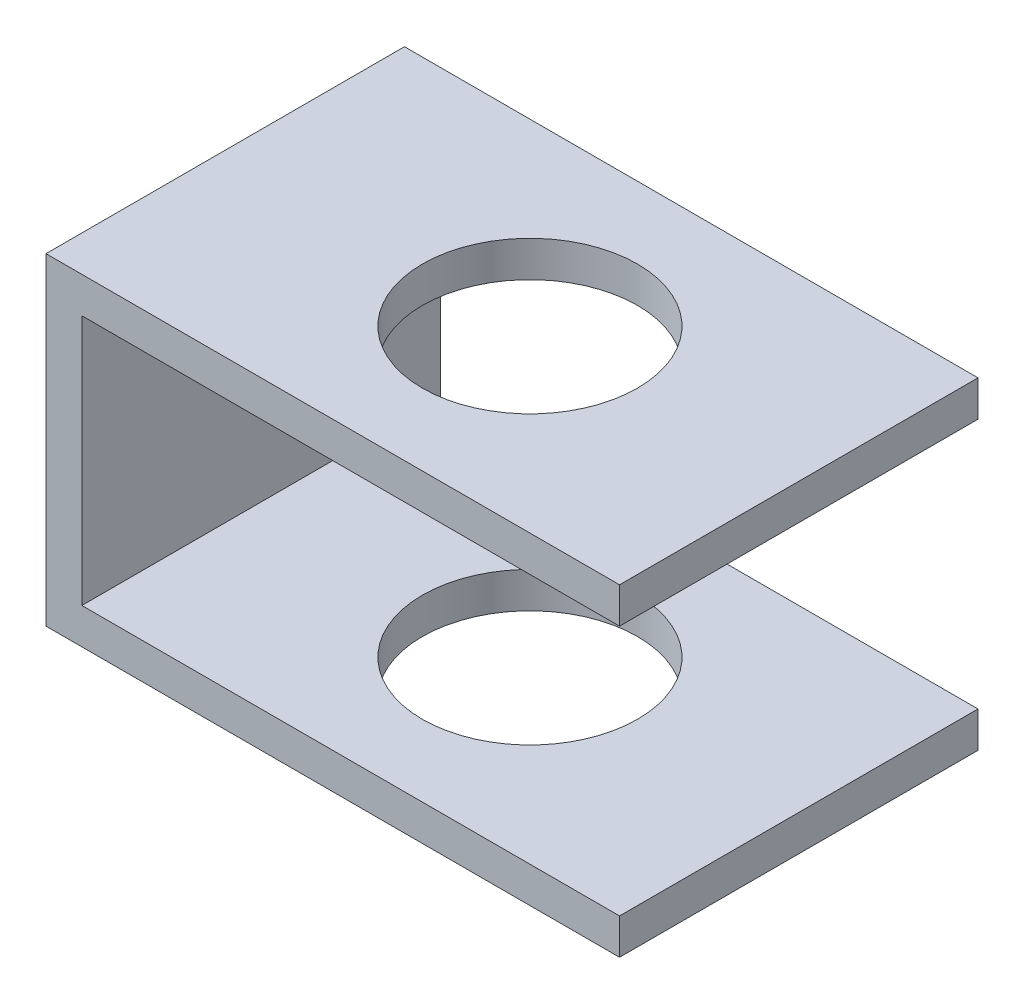
ISO-10303-21;
HEADER;
FILE_DESCRIPTION(('STEP AP214'),'2;1');
FILE_NAME('part.step','',(''),(''),'','','');
FILE_SCHEMA(('AUTOMOTIVE_DESIGN { 1 0 10303 214 1 1 1 1 }'));
ENDSEC;
DATA;
#1=APPLICATION_CONTEXT('core data for automotive mechanical design processes');
#2=APPLICATION_PROTOCOL_DEFINITION('international standard','automotive_design',2000,#1);
#3=PRODUCT_CONTEXT('',#1,'mechanical');
#4=PRODUCT('Part','Part','',(#3));
#5=PRODUCT_RELATED_PRODUCT_CATEGORY('part','',(#4));
#6=PRODUCT_DEFINITION_FORMATION('','',#4);
#7=PRODUCT_DEFINITION_CONTEXT('part definition',#1,'design');
#8=PRODUCT_DEFINITION('design','',#6,#7);
#9=PRODUCT_DEFINITION_SHAPE('','',#8);
#10=(LENGTH_UNIT() NAMED_UNIT(*) SI_UNIT(.MILLI.,.METRE.));
#11=(NAMED_UNIT(*) PLANE_ANGLE_UNIT() SI_UNIT($,.RADIAN.));
#12=(NAMED_UNIT(*) SI_UNIT($,.STERADIAN.) SOLID_ANGLE_UNIT());
#13=UNCERTAINTY_MEASURE_WITH_UNIT(LENGTH_MEASURE(1.E-05),#10,'distance_accuracy_value','');
#14=(GEOMETRIC_REPRESENTATION_CONTEXT(3) GLOBAL_UNCERTAINTY_ASSIGNED_CONTEXT((#13)) GLOBAL_UNIT_ASSIGNED_CONTEXT((#10,
#11,#12)) REPRESENTATION_CONTEXT('',''));
#15=CARTESIAN_POINT('',(0.,0.,0.));
#16=DIRECTION('',(0.,0.,1.));
#17=DIRECTION('',(1.,0.,0.));
#18=AXIS2_PLACEMENT_3D('',#15,#16,#17);
#19=CARTESIAN_POINT('',(1.6,0.,1.));
#20=DIRECTION('',(-1.,0.,0.));
#21=DIRECTION('',(0.,0.,1.));
#22=AXIS2_PLACEMENT_3D('',#19,#20,#21);
#23=PLANE('',#22);
#24=DIRECTION('',(0.,1.,0.));
#25=VECTOR('',#24,1.);
#26=CARTESIAN_POINT('',(1.6,0.,1.));
#27=LINE('',#26,#25);
#28=CARTESIAN_POINT('',(1.6,-0.1,1.));
#29=VERTEX_POINT('',#28);
#30=CARTESIAN_POINT('',(1.6,0.,1.));
#31=VERTEX_POINT('',#30);
#32=EDGE_CURVE('E146',#29,#31,#27,.T.);
#33=ORIENTED_EDGE('',*,*,#32,.F.);
#34=DIRECTION('',(0.,0.,1.));
#35=VECTOR('',#34,1.);
#36=CARTESIAN_POINT('',(1.6,-0.1,1.));
#37=LINE('',#36,#35);
#38=CARTESIAN_POINT('',(1.6,-0.1,0.));
#39=VERTEX_POINT('',#38);
#40=EDGE_CURVE('E124',#39,#29,#37,.T.);
#41=ORIENTED_EDGE('',*,*,#40,.F.);
#42=DIRECTION('',(0.,1.,0.));
#43=VECTOR('',#42,1.);
#44=CARTESIAN_POINT('',(1.6,0.,0.));
#45=LINE('',#44,#43);
#46=CARTESIAN_POINT('',(1.6,0.,0.));
#47=VERTEX_POINT('',#46);
#48=EDGE_CURVE('E154',#39,#47,#45,.T.);
#49=ORIENTED_EDGE('',*,*,#48,.T.);
#50=DIRECTION('',(0.,0.,-1.));
#51=VECTOR('',#50,1.);
#52=CARTESIAN_POINT('',(1.6,0.,1.));
#53=LINE('',#52,#51);
#54=EDGE_CURVE('E160',#31,#47,#53,.T.);
#55=ORIENTED_EDGE('',*,*,#54,.F.);
#56=EDGE_LOOP('',(#33,#41,#49,#55));
#57=FACE_BOUND('',#56,.T.);
#58=ADVANCED_FACE('F33',(#57),#23,.F.);
#59=CARTESIAN_POINT('',(0.85,-1.,0.5));
#60=DIRECTION('',(0.,1.,0.));
#61=DIRECTION('',(0.,0.,1.));
#62=AXIS2_PLACEMENT_3D('',#59,#60,#61);
#63=CYLINDRICAL_SURFACE('',#62,0.3);
#64=CARTESIAN_POINT('',(0.85,-0.1,0.5));
#65=DIRECTION('',(0.,1.,0.));
#66=DIRECTION('',(0.,0.,1.));
#67=AXIS2_PLACEMENT_3D('',#64,#65,#66);
#68=CIRCLE('',#67,0.3);
#69=CARTESIAN_POINT('',(0.85,-0.1,0.8));
#70=VERTEX_POINT('',#69);
#71=EDGE_CURVE('E37',#70,#70,#68,.F.);
#72=ORIENTED_EDGE('',*,*,#71,.T.);
#73=EDGE_LOOP('',(#72));
#74=FACE_BOUND('',#73,.T.);
#75=CARTESIAN_POINT('',(0.85,0.,0.5));
#76=DIRECTION('',(0.,1.,0.));
#77=DIRECTION('',(0.,0.,1.));
#78=AXIS2_PLACEMENT_3D('',#75,#76,#77);
#79=CIRCLE('',#78,0.3);
#80=CARTESIAN_POINT('',(0.85,0.,0.8));
#81=VERTEX_POINT('',#80);
#82=EDGE_CURVE('E136',#81,#81,#79,.T.);
#83=ORIENTED_EDGE('',*,*,#82,.T.);
#84=EDGE_LOOP('',(#83));
#85=FACE_BOUND('',#84,.T.);
#86=ADVANCED_FACE('F204',(#74,#85),#63,.F.);
#87=CARTESIAN_POINT('',(0.,0.,1.));
#88=DIRECTION('',(1.,0.,0.));
#89=DIRECTION('',(0.,1.,0.));
#90=AXIS2_PLACEMENT_3D('',#87,#88,#89);
#91=PLANE('',#90);
#92=DIRECTION('',(0.,-1.,0.));
#93=VECTOR('',#92,1.);
#94=CARTESIAN_POINT('',(0.,0.,0.));
#95=LINE('',#94,#93);
#96=CARTESIAN_POINT('',(0.,0.,0.));
#97=VERTEX_POINT('',#96);
#98=CARTESIAN_POINT('',(0.,-0.9,0.));
#99=VERTEX_POINT('',#98);
#100=EDGE_CURVE('E142',#97,#99,#95,.T.);
#101=ORIENTED_EDGE('',*,*,#100,.T.);
#102=DIRECTION('',(0.,0.,-1.));
#103=VECTOR('',#102,1.);
#104=CARTESIAN_POINT('',(0.,-0.9,1.));
#105=LINE('',#104,#103);
#106=CARTESIAN_POINT('',(0.,-0.9,1.));
#107=VERTEX_POINT('',#106);
#108=EDGE_CURVE('E11',#107,#99,#105,.T.);
#109=ORIENTED_EDGE('',*,*,#108,.F.);
#110=DIRECTION('',(0.,-1.,0.));
#111=VECTOR('',#110,1.);
#112=CARTESIAN_POINT('',(0.,0.,1.));
#113=LINE('',#112,#111);
#114=CARTESIAN_POINT('',(0.,0.,1.));
#115=VERTEX_POINT('',#114);
#116=EDGE_CURVE('E143',#115,#107,#113,.T.);
#117=ORIENTED_EDGE('',*,*,#116,.F.);
#118=DIRECTION('',(0.,0.,-1.));
#119=VECTOR('',#118,1.);
#120=CARTESIAN_POINT('',(0.,0.,1.));
#121=LINE('',#120,#119);
#122=EDGE_CURVE('E149',#115,#97,#121,.T.);
#123=ORIENTED_EDGE('',*,*,#122,.T.);
#124=EDGE_LOOP('',(#101,#109,#117,#123));
#125=FACE_BOUND('',#124,.T.);
#126=ADVANCED_FACE('F35',(#125),#91,.F.);
#127=CARTESIAN_POINT('',(0.,-0.9,1.));
#128=DIRECTION('',(0.,1.,0.));
#129=DIRECTION('',(0.,0.,1.));
#130=AXIS2_PLACEMENT_3D('',#127,#128,#129);
#131=PLANE('',#130);
#132=CARTESIAN_POINT('',(0.85,-0.9,0.5));
#133=DIRECTION('',(0.,1.,0.));
#134=DIRECTION('',(0.,0.,1.));
#135=AXIS2_PLACEMENT_3D('',#132,#133,#134);
#136=CIRCLE('',#135,0.3);
#137=CARTESIAN_POINT('',(0.85,-0.9,0.8));
#138=VERTEX_POINT('',#137);
#139=EDGE_CURVE('E139',#138,#138,#136,.T.);
#140=ORIENTED_EDGE('',*,*,#139,.T.);
#141=EDGE_LOOP('',(#140));
#142=FACE_BOUND('',#141,.T.);
#143=DIRECTION('',(1.,0.,0.));
#144=VECTOR('',#143,1.);
#145=CARTESIAN_POINT('',(0.,-0.9,0.));
#146=LINE('',#145,#144);
#147=CARTESIAN_POINT('',(1.6,-0.9,0.));
#148=VERTEX_POINT('',#147);
#149=EDGE_CURVE('E152',#99,#148,#146,.T.);
#150=ORIENTED_EDGE('',*,*,#149,.T.);
#151=DIRECTION('',(0.,0.,-1.));
#152=VECTOR('',#151,1.);
#153=CARTESIAN_POINT('',(1.6,-0.9,1.));
#154=LINE('',#153,#152);
#155=CARTESIAN_POINT('',(1.6,-0.9,1.));
#156=VERTEX_POINT('',#155);
#157=EDGE_CURVE('E42',#156,#148,#154,.T.);
#158=ORIENTED_EDGE('',*,*,#157,.F.);
#159=DIRECTION('',(1.,0.,0.));
#160=VECTOR('',#159,1.);
#161=CARTESIAN_POINT('',(0.,-0.9,1.));
#162=LINE('',#161,#160);
#163=EDGE_CURVE('E87',#107,#156,#162,.T.);
#164=ORIENTED_EDGE('',*,*,#163,.F.);
#165=ORIENTED_EDGE('',*,*,#108,.T.);
#166=EDGE_LOOP('',(#150,#158,#164,#165));
#167=FACE_BOUND('',#166,.T.);
#168=ADVANCED_FACE('F190',(#142,#167),#131,.F.);
#169=CARTESIAN_POINT('',(1.6,-0.8,0.));
#170=VERTEX_POINT('',#169);
#171=EDGE_CURVE('E155',#148,#170,#45,.T.);
#172=ORIENTED_EDGE('',*,*,#171,.T.);
#173=DIRECTION('',(0.,0.,-1.));
#174=VECTOR('',#173,1.);
#175=CARTESIAN_POINT('',(1.6,-0.8,1.));
#176=LINE('',#175,#174);
#177=CARTESIAN_POINT('',(1.6,-0.8,1.));
#178=VERTEX_POINT('',#177);
#179=EDGE_CURVE('E173',#178,#170,#176,.T.);
#180=ORIENTED_EDGE('',*,*,#179,.F.);
#181=EDGE_CURVE('E129',#156,#178,#27,.T.);
#182=ORIENTED_EDGE('',*,*,#181,.F.);
#183=ORIENTED_EDGE('',*,*,#157,.T.);
#184=EDGE_LOOP('',(#172,#180,#182,#183));
#185=FACE_BOUND('',#184,.T.);
#186=ADVANCED_FACE('F193',(#185),#23,.F.);
#187=CARTESIAN_POINT('',(0.,0.,1.));
#188=DIRECTION('',(0.,-1.,0.));
#189=DIRECTION('',(0.,0.,-1.));
#190=AXIS2_PLACEMENT_3D('',#187,#188,#189);
#191=PLANE('',#190);
#192=ORIENTED_EDGE('',*,*,#82,.F.);
#193=EDGE_LOOP('',(#192));
#194=FACE_BOUND('',#193,.T.);
#195=DIRECTION('',(-1.,0.,0.));
#196=VECTOR('',#195,1.);
#197=CARTESIAN_POINT('',(0.,0.,0.));
#198=LINE('',#197,#196);
#199=EDGE_CURVE('E80',#47,#97,#198,.T.);
#200=ORIENTED_EDGE('',*,*,#199,.T.);
#201=ORIENTED_EDGE('',*,*,#122,.F.);
#202=DIRECTION('',(-1.,0.,0.));
#203=VECTOR('',#202,1.);
#204=CARTESIAN_POINT('',(0.,0.,1.));
#205=LINE('',#204,#203);
#206=EDGE_CURVE('E59',#31,#115,#205,.T.);
#207=ORIENTED_EDGE('',*,*,#206,.F.);
#208=ORIENTED_EDGE('',*,*,#54,.T.);
#209=EDGE_LOOP('',(#200,#201,#207,#208));
#210=FACE_BOUND('',#209,.T.);
#211=ADVANCED_FACE('F186',(#194,#210),#191,.F.);
#212=CARTESIAN_POINT('',(0.,0.,1.));
#213=DIRECTION('',(0.,0.,1.));
#214=DIRECTION('',(1.,0.,0.));
#215=AXIS2_PLACEMENT_3D('',#212,#213,#214);
#216=PLANE('',#215);
#217=DIRECTION('',(1.,0.,0.));
#218=VECTOR('',#217,1.);
#219=CARTESIAN_POINT('',(0.1,-0.1,1.));
#220=LINE('',#219,#218);
#221=CARTESIAN_POINT('',(0.1,-0.1,1.));
#222=VERTEX_POINT('',#221);
#223=EDGE_CURVE('E165',#222,#29,#220,.T.);
#224=ORIENTED_EDGE('',*,*,#223,.T.);
#225=ORIENTED_EDGE('',*,*,#32,.T.);
#226=ORIENTED_EDGE('',*,*,#206,.T.);
#227=ORIENTED_EDGE('',*,*,#116,.T.);
#228=ORIENTED_EDGE('',*,*,#163,.T.);
#229=ORIENTED_EDGE('',*,*,#181,.T.);
#230=DIRECTION('',(1.,0.,0.));
#231=VECTOR('',#230,1.);
#232=CARTESIAN_POINT('',(0.1,-0.8,1.));
#233=LINE('',#232,#231);
#234=CARTESIAN_POINT('',(0.1,-0.8,1.));
#235=VERTEX_POINT('',#234);
#236=EDGE_CURVE('E110',#235,#178,#233,.T.);
#237=ORIENTED_EDGE('',*,*,#236,.F.);
#238=DIRECTION('',(0.,-1.,0.));
#239=VECTOR('',#238,1.);
#240=CARTESIAN_POINT('',(0.1,-0.1,1.));
#241=LINE('',#240,#239);
#242=EDGE_CURVE('E116',#222,#235,#241,.T.);
#243=ORIENTED_EDGE('',*,*,#242,.F.);
#244=EDGE_LOOP('',(#224,#225,#226,#227,#228,#229,#237,#243));
#245=FACE_BOUND('',#244,.T.);
#246=ADVANCED_FACE('F127',(#245),#216,.T.);
#247=CARTESIAN_POINT('',(0.,0.,0.));
#248=DIRECTION('',(0.,0.,1.));
#249=DIRECTION('',(1.,0.,0.));
#250=AXIS2_PLACEMENT_3D('',#247,#248,#249);
#251=PLANE('',#250);
#252=ORIENTED_EDGE('',*,*,#48,.F.);
#253=DIRECTION('',(1.,0.,0.));
#254=VECTOR('',#253,1.);
#255=CARTESIAN_POINT('',(0.1,-0.1,0.));
#256=LINE('',#255,#254);
#257=CARTESIAN_POINT('',(0.1,-0.1,0.));
#258=VERTEX_POINT('',#257);
#259=EDGE_CURVE('E131',#258,#39,#256,.T.);
#260=ORIENTED_EDGE('',*,*,#259,.F.);
#261=DIRECTION('',(0.,1.,0.));
#262=VECTOR('',#261,1.);
#263=CARTESIAN_POINT('',(0.1,-0.1,0.));
#264=LINE('',#263,#262);
#265=CARTESIAN_POINT('',(0.1,-0.8,0.));
#266=VERTEX_POINT('',#265);
#267=EDGE_CURVE('E115',#266,#258,#264,.T.);
#268=ORIENTED_EDGE('',*,*,#267,.F.);
#269=DIRECTION('',(1.,0.,0.));
#270=VECTOR('',#269,1.);
#271=CARTESIAN_POINT('',(0.1,-0.8,0.));
#272=LINE('',#271,#270);
#273=EDGE_CURVE('E113',#266,#170,#272,.T.);
#274=ORIENTED_EDGE('',*,*,#273,.T.);
#275=ORIENTED_EDGE('',*,*,#171,.F.);
#276=ORIENTED_EDGE('',*,*,#149,.F.);
#277=ORIENTED_EDGE('',*,*,#100,.F.);
#278=ORIENTED_EDGE('',*,*,#199,.F.);
#279=EDGE_LOOP('',(#252,#260,#268,#274,#275,#276,#277,#278));
#280=FACE_BOUND('',#279,.T.);
#281=ADVANCED_FACE('F182',(#280),#251,.F.);
#282=CARTESIAN_POINT('',(0.85,-0.8,0.5));
#283=DIRECTION('',(0.,-1.,0.));
#284=DIRECTION('',(0.,0.,-1.));
#285=AXIS2_PLACEMENT_3D('',#282,#283,#284);
#286=CIRCLE('',#285,0.3);
#287=CARTESIAN_POINT('',(0.85,-0.8,0.2));
#288=VERTEX_POINT('',#287);
#289=EDGE_CURVE('E163',#288,#288,#286,.F.);
#290=ORIENTED_EDGE('',*,*,#289,.T.);
#291=EDGE_LOOP('',(#290));
#292=FACE_BOUND('',#291,.T.);
#293=ORIENTED_EDGE('',*,*,#139,.F.);
#294=EDGE_LOOP('',(#293));
#295=FACE_BOUND('',#294,.T.);
#296=ADVANCED_FACE('F210',(#292,#295),#63,.F.);
#297=CARTESIAN_POINT('',(0.1,-0.1,1.));
#298=DIRECTION('',(0.,1.,0.));
#299=DIRECTION('',(0.,0.,1.));
#300=AXIS2_PLACEMENT_3D('',#297,#298,#299);
#301=PLANE('',#300);
#302=ORIENTED_EDGE('',*,*,#40,.T.);
#303=ORIENTED_EDGE('',*,*,#223,.F.);
#304=DIRECTION('',(0.,0.,1.));
#305=VECTOR('',#304,1.);
#306=CARTESIAN_POINT('',(0.1,-0.1,1.));
#307=LINE('',#306,#305);
#308=EDGE_CURVE('E122',#258,#222,#307,.T.);
#309=ORIENTED_EDGE('',*,*,#308,.F.);
#310=ORIENTED_EDGE('',*,*,#259,.T.);
#311=EDGE_LOOP('',(#302,#303,#309,#310));
#312=FACE_BOUND('',#311,.T.);
#313=ORIENTED_EDGE('',*,*,#71,.F.);
#314=EDGE_LOOP('',(#313));
#315=FACE_BOUND('',#314,.T.);
#316=ADVANCED_FACE('F178',(#312,#315),#301,.F.);
#317=CARTESIAN_POINT('',(0.1,-0.8,1.));
#318=DIRECTION('',(0.,-1.,0.));
#319=DIRECTION('',(0.,0.,-1.));
#320=AXIS2_PLACEMENT_3D('',#317,#318,#319);
#321=PLANE('',#320);
#322=ORIENTED_EDGE('',*,*,#179,.T.);
#323=ORIENTED_EDGE('',*,*,#273,.F.);
#324=DIRECTION('',(0.,0.,-1.));
#325=VECTOR('',#324,1.);
#326=CARTESIAN_POINT('',(0.1,-0.8,1.));
#327=LINE('',#326,#325);
#328=EDGE_CURVE('E50',#235,#266,#327,.T.);
#329=ORIENTED_EDGE('',*,*,#328,.F.);
#330=ORIENTED_EDGE('',*,*,#236,.T.);
#331=EDGE_LOOP('',(#322,#323,#329,#330));
#332=FACE_BOUND('',#331,.T.);
#333=ORIENTED_EDGE('',*,*,#289,.F.);
#334=EDGE_LOOP('',(#333));
#335=FACE_BOUND('',#334,.T.);
#336=ADVANCED_FACE('F107',(#332,#335),#321,.F.);
#337=CARTESIAN_POINT('',(0.1,0.,0.));
#338=DIRECTION('',(1.,0.,0.));
#339=DIRECTION('',(0.,0.,-1.));
#340=AXIS2_PLACEMENT_3D('',#337,#338,#339);
#341=PLANE('',#340);
#342=ORIENTED_EDGE('',*,*,#242,.T.);
#343=ORIENTED_EDGE('',*,*,#328,.T.);
#344=ORIENTED_EDGE('',*,*,#267,.T.);
#345=ORIENTED_EDGE('',*,*,#308,.T.);
#346=EDGE_LOOP('',(#342,#343,#344,#345));
#347=FACE_BOUND('',#346,.T.);
#348=ADVANCED_FACE('F120',(#347),#341,.T.);
#349=CLOSED_SHELL('',(#58,#86,#126,#168,#186,#211,#246,#281,#296,#316,#336,#348));
#350=MANIFOLD_SOLID_BREP('B2',#349);
#351=ADVANCED_BREP_SHAPE_REPRESENTATION('',(#18,#350),#14);
#352=SHAPE_DEFINITION_REPRESENTATION(#9,#351);
ENDSEC;
END-ISO-10303-21;
